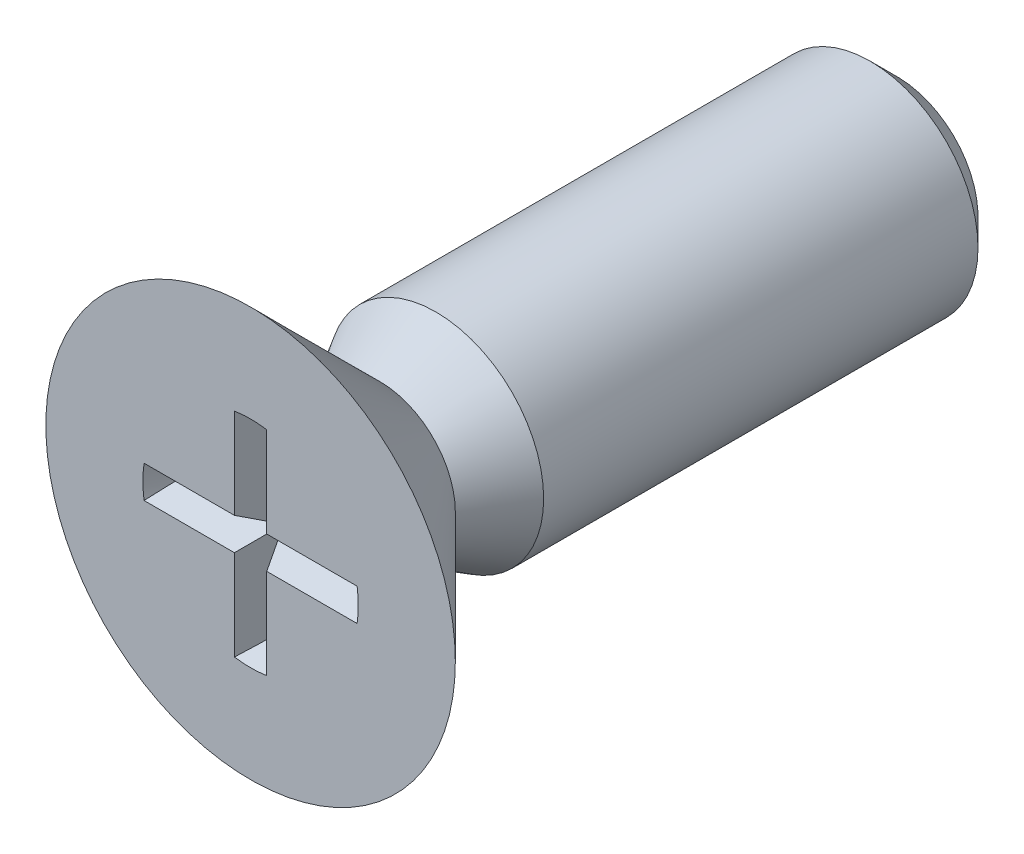
ISO-10303-21;
HEADER;
FILE_DESCRIPTION(('STEP AP214'),'2;1');
FILE_NAME('part.step','',(''),(''),'','','');
FILE_SCHEMA(('AUTOMOTIVE_DESIGN { 1 0 10303 214 1 1 1 1 }'));
ENDSEC;
DATA;
#1=APPLICATION_CONTEXT('core data for automotive mechanical design processes');
#2=APPLICATION_PROTOCOL_DEFINITION('international standard','automotive_design',2000,#1);
#3=PRODUCT_CONTEXT('',#1,'mechanical');
#4=PRODUCT('Part','Part','',(#3));
#5=PRODUCT_RELATED_PRODUCT_CATEGORY('part','',(#4));
#6=PRODUCT_DEFINITION_FORMATION('','',#4);
#7=PRODUCT_DEFINITION_CONTEXT('part definition',#1,'design');
#8=PRODUCT_DEFINITION('design','',#6,#7);
#9=PRODUCT_DEFINITION_SHAPE('','',#8);
#10=(LENGTH_UNIT() NAMED_UNIT(*) SI_UNIT(.MILLI.,.METRE.));
#11=(NAMED_UNIT(*) PLANE_ANGLE_UNIT() SI_UNIT($,.RADIAN.));
#12=(NAMED_UNIT(*) SI_UNIT($,.STERADIAN.) SOLID_ANGLE_UNIT());
#13=UNCERTAINTY_MEASURE_WITH_UNIT(LENGTH_MEASURE(1.E-05),#10,'distance_accuracy_value','');
#14=(GEOMETRIC_REPRESENTATION_CONTEXT(3) GLOBAL_UNCERTAINTY_ASSIGNED_CONTEXT((#13)) GLOBAL_UNIT_ASSIGNED_CONTEXT((#10,
#11,#12)) REPRESENTATION_CONTEXT('',''));
#15=CARTESIAN_POINT('',(0.,0.,0.));
#16=DIRECTION('',(0.,0.,1.));
#17=DIRECTION('',(1.,0.,0.));
#18=AXIS2_PLACEMENT_3D('',#15,#16,#17);
#19=CARTESIAN_POINT('',(0.,0.,0.));
#20=DIRECTION('',(0.,0.,0.999999999999933));
#21=DIRECTION('',(0.999999999999925,0.,0.));
#22=AXIS2_PLACEMENT_3D('',#19,#20,#21);
#23=PLANE('',#22);
#24=DIRECTION('',(-0.999999999999925,0.,0.));
#25=VECTOR('',#24,1.);
#26=CARTESIAN_POINT('',(-0.149999999999595,0.149999999999609,0.));
#27=LINE('',#26,#25);
#28=CARTESIAN_POINT('',(-0.149999999999595,0.149999999999609,0.));
#29=VERTEX_POINT('',#28);
#30=CARTESIAN_POINT('',(-0.98868599666313,0.149999999999595,0.));
#31=VERTEX_POINT('',#30);
#32=EDGE_CURVE('E63',#29,#31,#27,.T.);
#33=ORIENTED_EDGE('',*,*,#32,.F.);
#34=DIRECTION('',(0.,-1.,0.));
#35=VECTOR('',#34,1.);
#36=CARTESIAN_POINT('',(-0.149999999999595,0.149999999999609,0.));
#37=LINE('',#36,#35);
#38=CARTESIAN_POINT('',(-0.149999999999845,0.988685996664171,0.));
#39=VERTEX_POINT('',#38);
#40=EDGE_CURVE('E163',#39,#29,#37,.T.);
#41=ORIENTED_EDGE('',*,*,#40,.F.);
#42=CARTESIAN_POINT('',(0.,0.,0.));
#43=DIRECTION('',(0.,0.,0.999999999999933));
#44=DIRECTION('',(0.999999999999925,0.,0.));
#45=AXIS2_PLACEMENT_3D('',#42,#43,#44);
#46=CIRCLE('',#45,1.);
#47=CARTESIAN_POINT('',(0.149999999998679,0.988685996663907,0.));
#48=VERTEX_POINT('',#47);
#49=EDGE_CURVE('E160',#48,#39,#46,.T.);
#50=ORIENTED_EDGE('',*,*,#49,.F.);
#51=DIRECTION('',(0.,1.,0.));
#52=VECTOR('',#51,1.);
#53=CARTESIAN_POINT('',(0.149999999998679,0.988685996663907,0.));
#54=LINE('',#53,#52);
#55=CARTESIAN_POINT('',(0.149999999999428,0.149999999999817,0.));
#56=VERTEX_POINT('',#55);
#57=EDGE_CURVE('E157',#56,#48,#54,.T.);
#58=ORIENTED_EDGE('',*,*,#57,.F.);
#59=DIRECTION('',(-0.999999999999925,0.,0.));
#60=VECTOR('',#59,1.);
#61=CARTESIAN_POINT('',(0.149999999999428,0.149999999999817,0.));
#62=LINE('',#61,#60);
#63=CARTESIAN_POINT('',(0.988685996663963,0.149999999999914,0.));
#64=VERTEX_POINT('',#63);
#65=EDGE_CURVE('E154',#64,#56,#62,.T.);
#66=ORIENTED_EDGE('',*,*,#65,.F.);
#67=CARTESIAN_POINT('',(0.,0.,0.));
#68=DIRECTION('',(0.,0.,0.999999999999933));
#69=DIRECTION('',(0.999999999999925,0.,0.));
#70=AXIS2_PLACEMENT_3D('',#67,#68,#69);
#71=CIRCLE('',#70,1.);
#72=CARTESIAN_POINT('',(0.988685996663824,-0.150000000000136,0.));
#73=VERTEX_POINT('',#72);
#74=EDGE_CURVE('E151',#73,#64,#71,.T.);
#75=ORIENTED_EDGE('',*,*,#74,.F.);
#76=DIRECTION('',(0.999999999999925,0.,0.));
#77=VECTOR('',#76,1.);
#78=CARTESIAN_POINT('',(0.150000000000039,-0.149999999999956,0.));
#79=LINE('',#78,#77);
#80=CARTESIAN_POINT('',(0.150000000000039,-0.149999999999956,0.));
#81=VERTEX_POINT('',#80);
#82=EDGE_CURVE('E148',#81,#73,#79,.T.);
#83=ORIENTED_EDGE('',*,*,#82,.F.);
#84=DIRECTION('',(0.,1.,0.));
#85=VECTOR('',#84,1.);
#86=CARTESIAN_POINT('',(0.150000000000039,-0.149999999999956,0.));
#87=LINE('',#86,#85);
#88=CARTESIAN_POINT('',(0.150000000000039,-0.988685996664226,0.));
#89=VERTEX_POINT('',#88);
#90=EDGE_CURVE('E145',#89,#81,#87,.T.);
#91=ORIENTED_EDGE('',*,*,#90,.F.);
#92=CARTESIAN_POINT('',(0.,0.,0.));
#93=DIRECTION('',(0.,0.,0.999999999999933));
#94=DIRECTION('',(0.999999999999925,0.,0.));
#95=AXIS2_PLACEMENT_3D('',#92,#93,#94);
#96=CIRCLE('',#95,1.);
#97=CARTESIAN_POINT('',(-0.14999999999965,-0.988685996664518,0.));
#98=VERTEX_POINT('',#97);
#99=EDGE_CURVE('E139',#98,#89,#96,.T.);
#100=ORIENTED_EDGE('',*,*,#99,.F.);
#101=DIRECTION('',(0.,-1.,0.));
#102=VECTOR('',#101,1.);
#103=CARTESIAN_POINT('',(-0.149999999998623,-0.150000000000511,0.));
#104=LINE('',#103,#102);
#105=CARTESIAN_POINT('',(-0.149999999998623,-0.150000000000511,0.));
#106=VERTEX_POINT('',#105);
#107=EDGE_CURVE('E137',#106,#98,#104,.T.);
#108=ORIENTED_EDGE('',*,*,#107,.F.);
#109=DIRECTION('',(0.999999999999925,0.,0.));
#110=VECTOR('',#109,1.);
#111=CARTESIAN_POINT('',(-0.149999999998623,-0.150000000000511,0.));
#112=LINE('',#111,#110);
#113=CARTESIAN_POINT('',(-0.98868599666363,-0.150000000000372,0.));
#114=VERTEX_POINT('',#113);
#115=EDGE_CURVE('E122',#114,#106,#112,.T.);
#116=ORIENTED_EDGE('',*,*,#115,.F.);
#117=CARTESIAN_POINT('',(0.,0.,0.));
#118=DIRECTION('',(0.,0.,0.999999999999933));
#119=DIRECTION('',(0.999999999999925,0.,0.));
#120=AXIS2_PLACEMENT_3D('',#117,#118,#119);
#121=CIRCLE('',#120,1.);
#122=EDGE_CURVE('E130',#31,#114,#121,.T.);
#123=ORIENTED_EDGE('',*,*,#122,.F.);
#124=EDGE_LOOP('',(#33,#41,#50,#58,#66,#75,#83,#91,#100,#108,#116,#123));
#125=FACE_BOUND('',#124,.T.);
#126=CARTESIAN_POINT('',(0.,0.,0.));
#127=DIRECTION('',(0.,0.,-0.999999999999933));
#128=DIRECTION('',(-0.999999999999925,0.,0.));
#129=AXIS2_PLACEMENT_3D('',#126,#127,#128);
#130=CIRCLE('',#129,1.9);
#131=CARTESIAN_POINT('',(1.89999999999995,0.,0.));
#132=VERTEX_POINT('',#131);
#133=EDGE_CURVE('E375',#132,#132,#130,.T.);
#134=ORIENTED_EDGE('',*,*,#133,.F.);
#135=EDGE_LOOP('',(#134));
#136=FACE_BOUND('',#135,.T.);
#137=ADVANCED_FACE('F48',(#125,#136),#23,.T.);
#138=CARTESIAN_POINT('',(0.,0.,-1.20000000000001));
#139=DIRECTION('',(0.,0.,0.999999999999933));
#140=DIRECTION('',(0.999999999999925,0.,0.));
#141=AXIS2_PLACEMENT_3D('',#138,#139,#140);
#142=CONICAL_SURFACE('',#141,0.700000000000005,0.785398163397446);
#143=CARTESIAN_POINT('',(0.,0.,-1.20000000000001));
#144=DIRECTION('',(0.,0.,-0.999999999999933));
#145=DIRECTION('',(-0.999999999999925,0.,0.));
#146=AXIS2_PLACEMENT_3D('',#143,#144,#145);
#147=CIRCLE('',#146,0.700000000000005);
#148=CARTESIAN_POINT('',(0.699999999999953,0.,-1.20000000000001));
#149=VERTEX_POINT('',#148);
#150=EDGE_CURVE('E372',#149,#149,#147,.T.);
#151=CARTESIAN_POINT('',(1.89999999999995,0.,0.));
#152=CARTESIAN_POINT('',(1.88749999999995,0.,-0.0124999999999998));
#153=CARTESIAN_POINT('',(1.87499999999995,0.,-0.0249999999999999));
#154=CARTESIAN_POINT('',(1.84999999999995,0.,-0.0500000000000001));
#155=CARTESIAN_POINT('',(1.83749999999995,0.,-0.0625000000000001));
#156=CARTESIAN_POINT('',(1.81249999999995,0.,-0.0875000000000003));
#157=CARTESIAN_POINT('',(1.79999999999995,0.,-0.1));
#158=CARTESIAN_POINT('',(1.77499999999995,0.,-0.125));
#159=CARTESIAN_POINT('',(1.76249999999995,0.,-0.137500000000001));
#160=CARTESIAN_POINT('',(1.73749999999995,0.,-0.162500000000001));
#161=CARTESIAN_POINT('',(1.72499999999995,0.,-0.175000000000001));
#162=CARTESIAN_POINT('',(1.69999999999995,0.,-0.200000000000001));
#163=CARTESIAN_POINT('',(1.68749999999995,0.,-0.212500000000001));
#164=CARTESIAN_POINT('',(1.66249999999995,0.,-0.237500000000001));
#165=CARTESIAN_POINT('',(1.64999999999995,0.,-0.250000000000001));
#166=CARTESIAN_POINT('',(1.62499999999995,0.,-0.275000000000001));
#167=CARTESIAN_POINT('',(1.61249999999995,0.,-0.287500000000001));
#168=CARTESIAN_POINT('',(1.58749999999995,0.,-0.312500000000001));
#169=CARTESIAN_POINT('',(1.57499999999995,0.,-0.325000000000002));
#170=CARTESIAN_POINT('',(1.54999999999995,0.,-0.350000000000002));
#171=CARTESIAN_POINT('',(1.53749999999995,0.,-0.362500000000002));
#172=CARTESIAN_POINT('',(1.51249999999995,0.,-0.387500000000002));
#173=CARTESIAN_POINT('',(1.49999999999995,0.,-0.400000000000002));
#174=CARTESIAN_POINT('',(1.47499999999995,0.,-0.425000000000002));
#175=CARTESIAN_POINT('',(1.46249999999995,0.,-0.437500000000002));
#176=CARTESIAN_POINT('',(1.43749999999995,0.,-0.462500000000002));
#177=CARTESIAN_POINT('',(1.42499999999995,0.,-0.475000000000002));
#178=CARTESIAN_POINT('',(1.39999999999995,0.,-0.500000000000003));
#179=CARTESIAN_POINT('',(1.38749999999995,0.,-0.512500000000003));
#180=CARTESIAN_POINT('',(1.36249999999995,0.,-0.537500000000003));
#181=CARTESIAN_POINT('',(1.34999999999995,0.,-0.550000000000003));
#182=CARTESIAN_POINT('',(1.32499999999995,0.,-0.575000000000003));
#183=CARTESIAN_POINT('',(1.31249999999995,0.,-0.587500000000003));
#184=CARTESIAN_POINT('',(1.28749999999995,0.,-0.612500000000003));
#185=CARTESIAN_POINT('',(1.27499999999995,0.,-0.625000000000003));
#186=CARTESIAN_POINT('',(1.24999999999995,0.,-0.650000000000004));
#187=CARTESIAN_POINT('',(1.23749999999995,0.,-0.662500000000004));
#188=CARTESIAN_POINT('',(1.21249999999995,0.,-0.687500000000004));
#189=CARTESIAN_POINT('',(1.19999999999995,0.,-0.700000000000004));
#190=CARTESIAN_POINT('',(1.17499999999995,0.,-0.725000000000004));
#191=CARTESIAN_POINT('',(1.16249999999995,0.,-0.737500000000004));
#192=CARTESIAN_POINT('',(1.13749999999995,0.,-0.762500000000004));
#193=CARTESIAN_POINT('',(1.12499999999995,0.,-0.775000000000004));
#194=CARTESIAN_POINT('',(1.09999999999995,0.,-0.800000000000004));
#195=CARTESIAN_POINT('',(1.08749999999995,0.,-0.812500000000005));
#196=CARTESIAN_POINT('',(1.06249999999995,0.,-0.837500000000005));
#197=CARTESIAN_POINT('',(1.04999999999995,0.,-0.850000000000005));
#198=CARTESIAN_POINT('',(1.02499999999995,0.,-0.875000000000005));
#199=CARTESIAN_POINT('',(1.01249999999995,0.,-0.887500000000005));
#200=CARTESIAN_POINT('',(0.987499999999951,0.,-0.912500000000005));
#201=CARTESIAN_POINT('',(0.974999999999951,0.,-0.925000000000005));
#202=CARTESIAN_POINT('',(0.949999999999952,0.,-0.950000000000005));
#203=CARTESIAN_POINT('',(0.937499999999952,0.,-0.962500000000005));
#204=CARTESIAN_POINT('',(0.912499999999952,0.,-0.987500000000005));
#205=CARTESIAN_POINT('',(0.899999999999952,0.,-1.00000000000001));
#206=CARTESIAN_POINT('',(0.874999999999952,0.,-1.02500000000001));
#207=CARTESIAN_POINT('',(0.862499999999952,0.,-1.03750000000001));
#208=CARTESIAN_POINT('',(0.837499999999952,0.,-1.06250000000001));
#209=CARTESIAN_POINT('',(0.824999999999952,0.,-1.07500000000001));
#210=CARTESIAN_POINT('',(0.799999999999953,0.,-1.10000000000001));
#211=CARTESIAN_POINT('',(0.787499999999953,0.,-1.11250000000001));
#212=CARTESIAN_POINT('',(0.762499999999953,0.,-1.13750000000001));
#213=CARTESIAN_POINT('',(0.749999999999953,0.,-1.15000000000001));
#214=CARTESIAN_POINT('',(0.724999999999953,0.,-1.17500000000001));
#215=CARTESIAN_POINT('',(0.712499999999953,0.,-1.18750000000001));
#216=CARTESIAN_POINT('',(0.699999999999953,0.,-1.20000000000001));
#217=B_SPLINE_CURVE_WITH_KNOTS('',3,(#151,#152,#153,#154,#155,#156,#157,#158,#159,#160,#161,
#162,#163,#164,#165,#166,#167,#168,#169,#170,#171,#172,#173,#174,#175,#176,#177,#178,#179,#180,
#181,#182,#183,#184,#185,#186,#187,#188,#189,#190,#191,#192,#193,#194,#195,#196,#197,#198,#199,
#200,#201,#202,#203,#204,#205,#206,#207,#208,#209,#210,#211,#212,#213,#214,#215,#216),
.UNSPECIFIED.,.F.,.F.,(4,2,2,2,2,2,2,2,2,2,2,2,2,2,2,2,2,2,2,2,2,2,2,2,2,2,2,2,2,2,2,2,4),(0.,
0.0530330085889911,0.106066017177982,0.159099025766973,0.212132034355964,0.265165042944955,
0.318198051533946,0.371231060122937,0.424264068711928,0.477297077300919,0.53033008588991,
0.583363094478901,0.636396103067892,0.689429111656883,0.742462120245875,0.795495128834866,
0.848528137423857,0.901561146012848,0.954594154601839,1.00762716319083,1.06066017177982,
1.11369318036881,1.1667261889578,1.21975919754679,1.27279220613579,1.32582521472478,
1.37885822331377,1.43189123190276,1.48492424049175,1.53795724908074,1.59099025766973,
1.64402326625872,1.69705627484771),.UNSPECIFIED.);
#218=EDGE_CURVE('BSEAM272',#132,#149,#217,.T.);
#219=ORIENTED_EDGE('',*,*,#133,.T.);
#220=ORIENTED_EDGE('',*,*,#150,.F.);
#221=ORIENTED_EDGE('',*,*,#218,.T.);
#222=ORIENTED_EDGE('',*,*,#218,.F.);
#223=EDGE_LOOP('',(#219,#221,#220,#222));
#224=FACE_BOUND('',#223,.T.);
#225=ADVANCED_FACE('F272',(#224),#142,.T.);
#226=CARTESIAN_POINT('',(0.,0.,-1.71961524227066));
#227=DIRECTION('',(0.,0.,-0.999999999999933));
#228=DIRECTION('',(-0.999999999999925,0.,0.));
#229=AXIS2_PLACEMENT_3D('',#226,#227,#228);
#230=CONICAL_SURFACE('',#229,1.,0.523598775598293);
#231=ORIENTED_EDGE('',*,*,#150,.T.);
#232=EDGE_LOOP('',(#231));
#233=FACE_BOUND('',#232,.T.);
#234=CARTESIAN_POINT('',(0.,0.,-1.71961524227066));
#235=DIRECTION('',(0.,0.,-0.999999999999933));
#236=DIRECTION('',(-0.999999999999925,0.,0.));
#237=AXIS2_PLACEMENT_3D('',#234,#235,#236);
#238=CIRCLE('',#237,1.);
#239=CARTESIAN_POINT('',(-1.00000000000029,0.,-1.71961524227066));
#240=VERTEX_POINT('',#239);
#241=EDGE_CURVE('E366',#240,#240,#238,.T.);
#242=ORIENTED_EDGE('',*,*,#241,.F.);
#243=EDGE_LOOP('',(#242));
#244=FACE_BOUND('',#243,.T.);
#245=ADVANCED_FACE('F268',(#233,#244),#230,.T.);
#246=CARTESIAN_POINT('',(-3.60822483003176E-13,0.,-6.00000000000001));
#247=DIRECTION('',(0.,0.,-0.999999999999933));
#248=DIRECTION('',(-0.999999999999925,0.,0.));
#249=AXIS2_PLACEMENT_3D('',#246,#247,#248);
#250=CYLINDRICAL_SURFACE('',#249,1.);
#251=CARTESIAN_POINT('',(-3.60822483003176E-13,0.,-5.74999999999999));
#252=DIRECTION('',(0.,0.,-0.999999999999933));
#253=DIRECTION('',(-0.999999999999925,0.,0.));
#254=AXIS2_PLACEMENT_3D('',#251,#252,#253);
#255=CIRCLE('',#254,1.);
#256=CARTESIAN_POINT('',(-1.00000000000029,0.,-5.74999999999999));
#257=VERTEX_POINT('',#256);
#258=EDGE_CURVE('E13',#257,#257,#255,.F.);
#259=CARTESIAN_POINT('',(-1.00000000000029,0.,-5.74999999999999));
#260=CARTESIAN_POINT('',(-1.00000000000029,0.,-5.70801682544031));
#261=CARTESIAN_POINT('',(-1.00000000000029,0.,-5.66603365088063));
#262=CARTESIAN_POINT('',(-1.00000000000029,0.,-5.58206730176127));
#263=CARTESIAN_POINT('',(-1.00000000000029,0.,-5.54008412720159));
#264=CARTESIAN_POINT('',(-1.00000000000029,0.,-5.45611777808223));
#265=CARTESIAN_POINT('',(-1.00000000000029,0.,-5.41413460352255));
#266=CARTESIAN_POINT('',(-1.00000000000029,0.,-5.33016825440319));
#267=CARTESIAN_POINT('',(-1.00000000000029,0.,-5.28818507984351));
#268=CARTESIAN_POINT('',(-1.00000000000029,0.,-5.20421873072414));
#269=CARTESIAN_POINT('',(-1.00000000000029,0.,-5.16223555616446));
#270=CARTESIAN_POINT('',(-1.00000000000029,0.,-5.0782692070451));
#271=CARTESIAN_POINT('',(-1.00000000000029,0.,-5.03628603248542));
#272=CARTESIAN_POINT('',(-1.00000000000029,0.,-4.95231968336606));
#273=CARTESIAN_POINT('',(-1.00000000000029,0.,-4.91033650880638));
#274=CARTESIAN_POINT('',(-1.00000000000029,0.,-4.82637015968702));
#275=CARTESIAN_POINT('',(-1.00000000000029,0.,-4.78438698512734));
#276=CARTESIAN_POINT('',(-1.00000000000029,0.,-4.70042063600798));
#277=CARTESIAN_POINT('',(-1.00000000000029,0.,-4.6584374614483));
#278=CARTESIAN_POINT('',(-1.00000000000029,0.,-4.57447111232894));
#279=CARTESIAN_POINT('',(-1.00000000000029,0.,-4.53248793776926));
#280=CARTESIAN_POINT('',(-1.00000000000029,0.,-4.44852158864989));
#281=CARTESIAN_POINT('',(-1.00000000000029,0.,-4.40653841409021));
#282=CARTESIAN_POINT('',(-1.00000000000029,0.,-4.32257206497085));
#283=CARTESIAN_POINT('',(-1.00000000000029,0.,-4.28058889041117));
#284=CARTESIAN_POINT('',(-1.00000000000029,0.,-4.19662254129181));
#285=CARTESIAN_POINT('',(-1.00000000000029,0.,-4.15463936673213));
#286=CARTESIAN_POINT('',(-1.00000000000029,0.,-4.07067301761277));
#287=CARTESIAN_POINT('',(-1.00000000000029,0.,-4.02868984305309));
#288=CARTESIAN_POINT('',(-1.00000000000029,0.,-3.94472349393373));
#289=CARTESIAN_POINT('',(-1.00000000000029,0.,-3.90274031937405));
#290=CARTESIAN_POINT('',(-1.00000000000029,0.,-3.81877397025469));
#291=CARTESIAN_POINT('',(-1.00000000000029,0.,-3.77679079569501));
#292=CARTESIAN_POINT('',(-1.00000000000029,0.,-3.69282444657564));
#293=CARTESIAN_POINT('',(-1.00000000000029,0.,-3.65084127201596));
#294=CARTESIAN_POINT('',(-1.00000000000029,0.,-3.5668749228966));
#295=CARTESIAN_POINT('',(-1.00000000000029,0.,-3.52489174833692));
#296=CARTESIAN_POINT('',(-1.00000000000029,0.,-3.44092539921756));
#297=CARTESIAN_POINT('',(-1.00000000000029,0.,-3.39894222465788));
#298=CARTESIAN_POINT('',(-1.00000000000029,0.,-3.31497587553852));
#299=CARTESIAN_POINT('',(-1.00000000000029,0.,-3.27299270097884));
#300=CARTESIAN_POINT('',(-1.00000000000029,0.,-3.18902635185948));
#301=CARTESIAN_POINT('',(-1.00000000000029,0.,-3.1470431772998));
#302=CARTESIAN_POINT('',(-1.00000000000029,0.,-3.06307682818044));
#303=CARTESIAN_POINT('',(-1.00000000000029,0.,-3.02109365362075));
#304=CARTESIAN_POINT('',(-1.00000000000029,0.,-2.93712730450139));
#305=CARTESIAN_POINT('',(-1.00000000000029,0.,-2.89514412994171));
#306=CARTESIAN_POINT('',(-1.00000000000029,0.,-2.81117778082235));
#307=CARTESIAN_POINT('',(-1.00000000000029,0.,-2.76919460626267));
#308=CARTESIAN_POINT('',(-1.00000000000029,0.,-2.68522825714331));
#309=CARTESIAN_POINT('',(-1.00000000000029,0.,-2.64324508258363));
#310=CARTESIAN_POINT('',(-1.00000000000029,0.,-2.55927873346427));
#311=CARTESIAN_POINT('',(-1.00000000000029,0.,-2.51729555890459));
#312=CARTESIAN_POINT('',(-1.00000000000029,0.,-2.43332920978523));
#313=CARTESIAN_POINT('',(-1.00000000000029,0.,-2.39134603522555));
#314=CARTESIAN_POINT('',(-1.00000000000029,0.,-2.30737968610618));
#315=CARTESIAN_POINT('',(-1.00000000000029,0.,-2.2653965115465));
#316=CARTESIAN_POINT('',(-1.00000000000029,0.,-2.18143016242714));
#317=CARTESIAN_POINT('',(-1.00000000000029,0.,-2.13944698786746));
#318=CARTESIAN_POINT('',(-1.00000000000029,0.,-2.0554806387481));
#319=CARTESIAN_POINT('',(-1.00000000000029,0.,-2.01349746418842));
#320=CARTESIAN_POINT('',(-1.00000000000029,0.,-1.92953111506906));
#321=CARTESIAN_POINT('',(-1.00000000000029,0.,-1.88754794050938));
#322=CARTESIAN_POINT('',(-1.00000000000029,0.,-1.80358159139002));
#323=CARTESIAN_POINT('',(-1.00000000000029,0.,-1.76159841683034));
#324=CARTESIAN_POINT('',(-1.00000000000029,0.,-1.71961524227066));
#325=B_SPLINE_CURVE_WITH_KNOTS('',3,(#259,#260,#261,#262,#263,#264,#265,#266,#267,#268,#269,
#270,#271,#272,#273,#274,#275,#276,#277,#278,#279,#280,#281,#282,#283,#284,#285,#286,#287,#288,
#289,#290,#291,#292,#293,#294,#295,#296,#297,#298,#299,#300,#301,#302,#303,#304,#305,#306,#307,
#308,#309,#310,#311,#312,#313,#314,#315,#316,#317,#318,#319,#320,#321,#322,#323,#324),
.UNSPECIFIED.,.F.,.F.,(4,2,2,2,2,2,2,2,2,2,2,2,2,2,2,2,2,2,2,2,2,2,2,2,2,2,2,2,2,2,2,2,4),(0.,
0.125949523679042,0.251899047358083,0.377848571037126,0.503798094716167,0.629747618395209,
0.75569714207425,0.881646665753293,1.00759618943233,1.13354571311138,1.25949523679042,
1.38544476046946,1.5113942841485,1.63734380782754,1.76329333150658,1.88924285518563,
2.01519237886467,2.14114190254371,2.26709142622275,2.39304094990179,2.51899047358083,
2.64493999725988,2.77088952093892,2.89683904461796,3.022788568297,3.14873809197604,
3.27468761565509,3.40063713933413,3.52658666301317,3.65253618669221,3.77848571037125,
3.90443523405029,4.03038475772934),.UNSPECIFIED.);
#326=EDGE_CURVE('BSEAM264',#257,#240,#325,.T.);
#327=ORIENTED_EDGE('',*,*,#258,.T.);
#328=ORIENTED_EDGE('',*,*,#241,.T.);
#329=ORIENTED_EDGE('',*,*,#326,.T.);
#330=ORIENTED_EDGE('',*,*,#326,.F.);
#331=EDGE_LOOP('',(#327,#329,#328,#330));
#332=FACE_BOUND('',#331,.T.);
#333=ADVANCED_FACE('F264',(#332),#250,.T.);
#334=CARTESIAN_POINT('',(-0.999999999999918,0.,-6.00000000000001));
#335=DIRECTION('',(0.,0.,-0.999999999999933));
#336=DIRECTION('',(-0.999999999999925,0.,0.));
#337=AXIS2_PLACEMENT_3D('',#334,#335,#336);
#338=PLANE('',#337);
#339=CARTESIAN_POINT('',(-3.60822483003176E-13,0.,-6.00000000000001));
#340=DIRECTION('',(0.,0.,-0.999999999999933));
#341=DIRECTION('',(-0.999999999999925,0.,0.));
#342=AXIS2_PLACEMENT_3D('',#339,#340,#341);
#343=CIRCLE('',#342,0.749999999999997);
#344=CARTESIAN_POINT('',(-0.750000000000302,0.,-6.00000000000001));
#345=VERTEX_POINT('',#344);
#346=EDGE_CURVE('E56',#345,#345,#343,.T.);
#347=ORIENTED_EDGE('',*,*,#346,.T.);
#348=EDGE_LOOP('',(#347));
#349=FACE_BOUND('',#348,.T.);
#350=ADVANCED_FACE('F261',(#349),#338,.T.);
#351=CARTESIAN_POINT('',(-3.60822483003176E-13,0.,-6.00000000000001));
#352=DIRECTION('',(0.,0.,0.999999999999933));
#353=DIRECTION('',(0.999999999999925,0.,0.));
#354=AXIS2_PLACEMENT_3D('',#351,#352,#353);
#355=CONICAL_SURFACE('',#354,0.749999999999997,0.785398163397447);
#356=ORIENTED_EDGE('',*,*,#258,.F.);
#357=EDGE_LOOP('',(#356));
#358=FACE_BOUND('',#357,.T.);
#359=ORIENTED_EDGE('',*,*,#346,.F.);
#360=EDGE_LOOP('',(#359));
#361=FACE_BOUND('',#360,.T.);
#362=ADVANCED_FACE('F50',(#358,#361),#355,.T.);
#363=CARTESIAN_POINT('',(-0.149999999999595,0.149999999999609,0.));
#364=DIRECTION('',(0.,0.898794046299205,-0.438371146789045));
#365=DIRECTION('',(0.,0.438371146789089,0.8987940462991));
#366=AXIS2_PLACEMENT_3D('',#363,#364,#365);
#367=PLANE('',#366);
#368=DIRECTION('',(0.999999999999925,0.,0.));
#369=VECTOR('',#368,1.);
#370=CARTESIAN_POINT('',(-0.150000000000011,0.,-0.307545576236898));
#371=LINE('',#370,#369);
#372=CARTESIAN_POINT('',(-0.849999999998324,-3.88578058618805E-13,-0.30754557623687));
#373=VERTEX_POINT('',#372);
#374=CARTESIAN_POINT('',(0.,0.,-0.307545576236898));
#375=VERTEX_POINT('',#374);
#376=EDGE_CURVE('E124',#373,#375,#371,.T.);
#377=ORIENTED_EDGE('',*,*,#376,.T.);
#378=DIRECTION('',(-0.401488399504185,0.401488399504237,0.823173207852974));
#379=VECTOR('',#378,1.);
#380=CARTESIAN_POINT('',(-0.149999999999595,0.149999999999609,0.));
#381=LINE('',#380,#379);
#382=EDGE_CURVE('E166',#375,#29,#381,.T.);
#383=ORIENTED_EDGE('',*,*,#382,.T.);
#384=ORIENTED_EDGE('',*,*,#32,.T.);
#385=CARTESIAN_POINT('',(-0.255812547349826,-0.386505847422586,-1.1));
#386=CARTESIAN_POINT('',(-0.275449476755664,-0.380586949186411,-1.08786446020826));
#387=CARTESIAN_POINT('',(-0.294343623056731,-0.374230059116617,-1.07483090407753));
#388=CARTESIAN_POINT('',(-0.330763173530504,-0.360840964152099,-1.04737919123637));
#389=CARTESIAN_POINT('',(-0.348292174271361,-0.353810650647116,-1.0329649124496));
#390=CARTESIAN_POINT('',(-0.398801593069938,-0.332110001320866,-0.988471987771413));
#391=CARTESIAN_POINT('',(-0.430110390480368,-0.316697589843654,-0.956871861312072));
#392=CARTESIAN_POINT('',(-0.483444739600536,-0.287847492267538,-0.897720395421734));
#393=CARTESIAN_POINT('',(-0.506083444637852,-0.274619707177513,-0.870599416835747));
#394=CARTESIAN_POINT('',(-0.54957831896426,-0.247609187079543,-0.815219643715576));
#395=CARTESIAN_POINT('',(-0.570434061972281,-0.233826320511742,-0.786960579443713));
#396=CARTESIAN_POINT('',(-0.630884700857411,-0.191835984401508,-0.700867632007812));
#397=CARTESIAN_POINT('',(-0.668292969332029,-0.163026859804804,-0.641800173174592));
#398=CARTESIAN_POINT('',(-0.739433854687907,-0.104121699148738,-0.521026695992534));
#399=CARTESIAN_POINT('',(-0.773115774397824,-0.0740142144032057,-0.459297204358459));
#400=CARTESIAN_POINT('',(-0.837352283028038,-0.0131600904000827,-0.334527760138989));
#401=CARTESIAN_POINT('',(-0.86790612693324,0.0175866990328323,-0.27148749964855));
#402=CARTESIAN_POINT('',(-0.913221440905053,0.0654233686006166,-0.173407792265299));
#403=CARTESIAN_POINT('',(-0.928840990299744,0.0823593545789318,-0.138683875152964));
#404=CARTESIAN_POINT('',(-0.95929080095423,0.116182300541757,-0.0693365591117664));
#405=CARTESIAN_POINT('',(-0.974127128867204,0.133068209889194,-0.0347153143081323));
#406=CARTESIAN_POINT('',(-0.98868599666313,0.149999999999595,0.));
#407=B_SPLINE_CURVE_WITH_KNOTS('',3,(#385,#386,#387,#388,#389,#390,#391,#392,#393,#394,#395,
#396,#397,#398,#399,#400,#401,#402,#403,#404,#405,#406),.UNSPECIFIED.,.F.,.F.,(4,2,2,2,2,2,2,2,
2,2,4),(0.,0.0713922150153188,0.142589488762265,0.283481517406613,0.39659096109922,
0.509727372472828,0.736344172180906,0.965739833420187,1.19519000343479,1.32020137058027,
1.44403068561773),.UNSPECIFIED.);
#408=EDGE_CURVE('E127',#373,#31,#407,.T.);
#409=ORIENTED_EDGE('',*,*,#408,.F.);
#410=EDGE_LOOP('',(#377,#383,#384,#409));
#411=FACE_BOUND('',#410,.T.);
#412=ADVANCED_FACE('F180',(#411),#367,.F.);
#413=CARTESIAN_POINT('',(-0.149999999999595,0.149999999999609,0.));
#414=DIRECTION('',(-0.898794046299106,0.,-0.438371146789046));
#415=DIRECTION('',(-0.438371146789035,0.,0.8987940462991));
#416=AXIS2_PLACEMENT_3D('',#413,#414,#415);
#417=PLANE('',#416);
#418=CARTESIAN_POINT('',(0.386505847422058,0.255812547350354,-1.1));
#419=CARTESIAN_POINT('',(0.380586949186121,0.275449476756121,-1.08786446020808));
#420=CARTESIAN_POINT('',(0.374230059116462,0.294343623057129,-1.07483090407724));
#421=CARTESIAN_POINT('',(0.360840964152069,0.330763173530826,-1.04737919123599));
#422=CARTESIAN_POINT('',(0.353810650647076,0.348292174271664,-1.03296491244922));
#423=CARTESIAN_POINT('',(0.332110001320673,0.398801593070249,-0.98847198777118));
#424=CARTESIAN_POINT('',(0.316697589843197,0.430110390480766,-0.956871861312086));
#425=CARTESIAN_POINT('',(0.287847492267147,0.48344473960088,-0.897720395421708));
#426=CARTESIAN_POINT('',(0.274619707177343,0.506083444638099,-0.870599416835527));
#427=CARTESIAN_POINT('',(0.247609187079535,0.549578318964425,-0.815219643715202));
#428=CARTESIAN_POINT('',(0.233826320511676,0.570434061972463,-0.786960579443378));
#429=CARTESIAN_POINT('',(0.191835984401325,0.630884700857662,-0.700867632007528));
#430=CARTESIAN_POINT('',(0.163026859804629,0.668292969332332,-0.64180017317427));
#431=CARTESIAN_POINT('',(0.104121699148595,0.739433854688066,-0.521026695992044));
#432=CARTESIAN_POINT('',(0.0740142144030845,0.773115774397784,-0.459297204357837));
#433=CARTESIAN_POINT('',(0.0131600903998022,0.837352283028557,-0.334527760138676));
#434=CARTESIAN_POINT('',(-0.0175866990332942,0.867906126934517,-0.271487499648677));
#435=CARTESIAN_POINT('',(-0.0654233686009852,0.9132214409059,-0.173407792265255));
#436=CARTESIAN_POINT('',(-0.0823593545791851,0.928840990300124,-0.138683875152717));
#437=CARTESIAN_POINT('',(-0.116182300541816,0.959290800954152,-0.0693365591113383));
#438=CARTESIAN_POINT('',(-0.133068209889174,0.974127128867132,-0.0347153143077238));
#439=CARTESIAN_POINT('',(-0.149999999999595,0.988685996663824,0.));
#440=B_SPLINE_CURVE_WITH_KNOTS('',3,(#418,#419,#420,#421,#422,#423,#424,#425,#426,#427,#428,
#429,#430,#431,#432,#433,#434,#435,#436,#437,#438,#439),.UNSPECIFIED.,.F.,.F.,(4,2,2,2,2,2,2,2,
2,2,4),(0.,0.0713922150152465,0.142589488762153,0.283481517406427,0.396590961099037,
0.509727372472656,0.736344172180856,0.965739833420208,1.19519000343482,1.32020137058015,
1.44403068561745),.UNSPECIFIED.);
#441=CARTESIAN_POINT('',(-3.05311331771918E-13,0.849999999999851,-0.30754557623687));
#442=VERTEX_POINT('',#441);
#443=EDGE_CURVE('E169',#442,#39,#440,.T.);
#444=ORIENTED_EDGE('',*,*,#443,.T.);
#445=ORIENTED_EDGE('',*,*,#40,.T.);
#446=ORIENTED_EDGE('',*,*,#382,.F.);
#447=DIRECTION('',(0.,-1.,0.));
#448=VECTOR('',#447,1.);
#449=CARTESIAN_POINT('',(-3.88578058618805E-13,0.1499999999999,-0.307545576236898));
#450=LINE('',#449,#448);
#451=EDGE_CURVE('E168',#442,#375,#450,.T.);
#452=ORIENTED_EDGE('',*,*,#451,.F.);
#453=EDGE_LOOP('',(#444,#445,#446,#452));
#454=FACE_BOUND('',#453,.T.);
#455=ADVANCED_FACE('F256',(#454),#417,.F.);
#456=CARTESIAN_POINT('',(0.,0.,0.));
#457=DIRECTION('',(0.,0.,0.999999999999933));
#458=DIRECTION('',(0.999999999999925,0.,0.));
#459=AXIS2_PLACEMENT_3D('',#456,#457,#458);
#460=CONICAL_SURFACE('',#459,1.,0.453785605518527);
#461=ORIENTED_EDGE('',*,*,#49,.T.);
#462=ORIENTED_EDGE('',*,*,#443,.F.);
#463=CARTESIAN_POINT('',(-0.386505847422364,0.255812547350229,-1.1));
#464=CARTESIAN_POINT('',(-0.380586949186632,0.275449476755882,-1.08786446020778));
#465=CARTESIAN_POINT('',(-0.374230059117071,0.294343623056802,-1.07483090407678));
#466=CARTESIAN_POINT('',(-0.360840964152758,0.330763173530441,-1.04737919123537));
#467=CARTESIAN_POINT('',(-0.353810650647747,0.348292174271307,-1.03296491244861));
#468=CARTESIAN_POINT('',(-0.332110001321297,0.398801593070162,-0.988471987770807));
#469=CARTESIAN_POINT('',(-0.316697589843791,0.43011039048113,-0.956871861312123));
#470=CARTESIAN_POINT('',(-0.287847492267788,0.483444739601183,-0.897720395421712));
#471=CARTESIAN_POINT('',(-0.274619707178046,0.506083444638057,-0.87059941683525));
#472=CARTESIAN_POINT('',(-0.247609187080305,0.549578318964137,-0.815219643714744));
#473=CARTESIAN_POINT('',(-0.233826320512451,0.57043406197227,-0.786960579443021));
#474=CARTESIAN_POINT('',(-0.191835984402087,0.630884700857655,-0.700867632007341));
#475=CARTESIAN_POINT('',(-0.163026859805363,0.668292969332291,-0.641800173174052));
#476=CARTESIAN_POINT('',(-0.104121699149451,0.739433854688057,-0.521026695991755));
#477=CARTESIAN_POINT('',(-0.0740142144040949,0.773115774397844,-0.45929720435751));
#478=CARTESIAN_POINT('',(-0.013160090400404,0.837352283028637,-0.334527760138539));
#479=CARTESIAN_POINT('',(0.0175866990332552,0.867906126934548,-0.271487499648769));
#480=CARTESIAN_POINT('',(0.0654233686006671,0.913221440905994,-0.173407792265197));
#481=CARTESIAN_POINT('',(0.0823593545785496,0.928840990300267,-0.138683875152506));
#482=CARTESIAN_POINT('',(0.116182300540875,0.95929080095444,-0.0693365591110071));
#483=CARTESIAN_POINT('',(0.13306820988824,0.974127128867515,-0.0347153143074237));
#484=CARTESIAN_POINT('',(0.149999999999206,0.988685996664324,0.));
#485=B_SPLINE_CURVE_WITH_KNOTS('',3,(#463,#464,#465,#466,#467,#468,#469,#470,#471,#472,#473,
#474,#475,#476,#477,#478,#479,#480,#481,#482,#483,#484),.UNSPECIFIED.,.F.,.F.,(4,2,2,2,2,2,2,2,
2,2,4),(0.,0.071392215015254,0.142589488762241,0.283481517406577,0.39659096109909,
0.509727372472661,0.736344172180881,0.965739833420247,1.19519000343491,1.32020137058029,
1.44403068561763),.UNSPECIFIED.);
#486=EDGE_CURVE('E246',#442,#48,#485,.T.);
#487=ORIENTED_EDGE('',*,*,#486,.T.);
#488=EDGE_LOOP('',(#461,#462,#487));
#489=FACE_BOUND('',#488,.T.);
#490=ADVANCED_FACE('F242',(#489),#460,.F.);
#491=CARTESIAN_POINT('',(0.149999999998679,0.988685996663907,0.));
#492=DIRECTION('',(0.898794046299103,0.,-0.438371146789044));
#493=DIRECTION('',(-0.438371146789045,0.,-0.8987940462991));
#494=AXIS2_PLACEMENT_3D('',#491,#492,#493);
#495=PLANE('',#494);
#496=ORIENTED_EDGE('',*,*,#451,.T.);
#497=DIRECTION('',(0.401488399504195,0.401488399504229,0.823173207852974));
#498=VECTOR('',#497,1.);
#499=CARTESIAN_POINT('',(0.285190257292095,0.285190257292484,0.277181103870761));
#500=LINE('',#499,#498);
#501=EDGE_CURVE('E231',#375,#56,#500,.T.);
#502=ORIENTED_EDGE('',*,*,#501,.T.);
#503=ORIENTED_EDGE('',*,*,#57,.T.);
#504=ORIENTED_EDGE('',*,*,#486,.F.);
#505=EDGE_LOOP('',(#496,#502,#503,#504));
#506=FACE_BOUND('',#505,.T.);
#507=ADVANCED_FACE('F237',(#506),#495,.F.);
#508=CARTESIAN_POINT('',(0.149999999999428,0.149999999999817,0.));
#509=DIRECTION('',(0.,0.898794046299205,-0.438371146789045));
#510=DIRECTION('',(0.,0.438371146789089,0.8987940462991));
#511=AXIS2_PLACEMENT_3D('',#508,#509,#510);
#512=PLANE('',#511);
#513=CARTESIAN_POINT('',(0.255812547351242,-0.386505847422627,-1.1));
#514=CARTESIAN_POINT('',(0.275449476756748,-0.380586949186199,-1.08786446020802));
#515=CARTESIAN_POINT('',(0.294343623057598,-0.374230059116279,-1.07483090407719));
#516=CARTESIAN_POINT('',(0.330763173531112,-0.360840964151657,-1.04737919123597));
#517=CARTESIAN_POINT('',(0.348292174271924,-0.353810650646697,-1.03296491244923));
#518=CARTESIAN_POINT('',(0.39880159307049,-0.332110001320607,-0.988471987771197));
#519=CARTESIAN_POINT('',(0.430110390481067,-0.316697589843624,-0.956871861312026));
#520=CARTESIAN_POINT('',(0.483444739601071,-0.287847492267488,-0.89772039542172));
#521=CARTESIAN_POINT('',(0.506083444638166,-0.274619707177294,-0.870599416835639));
#522=CARTESIAN_POINT('',(0.549578318964388,-0.247609187079194,-0.81521964371539));
#523=CARTESIAN_POINT('',(0.570434061972445,-0.233826320511433,-0.786960579443545));
#524=CARTESIAN_POINT('',(0.630884700857674,-0.191835984401242,-0.700867632007644));
#525=CARTESIAN_POINT('',(0.668292969332314,-0.163026859804483,-0.641800173174385));
#526=CARTESIAN_POINT('',(0.739433854688026,-0.104121699148361,-0.52102669599219));
#527=CARTESIAN_POINT('',(0.773115774397756,-0.0740142144028275,-0.459297204358016));
#528=CARTESIAN_POINT('',(0.83735228302847,-0.0131600903997073,-0.334527760138772));
#529=CARTESIAN_POINT('',(0.86790612693436,0.0175866990332036,-0.271487499648657));
#530=CARTESIAN_POINT('',(0.913221440905768,0.0654233686009894,-0.173407792265248));
#531=CARTESIAN_POINT('',(0.928840990300033,0.0823593545793048,-0.138683875152733));
#532=CARTESIAN_POINT('',(0.959290800954167,0.116182300542118,-0.0693365591113846));
#533=CARTESIAN_POINT('',(0.974127128867209,0.133068209889542,-0.0347153143077761));
#534=CARTESIAN_POINT('',(0.988685996663963,0.149999999999914,0.));
#535=B_SPLINE_CURVE_WITH_KNOTS('',3,(#513,#514,#515,#516,#517,#518,#519,#520,#521,#522,#523,
#524,#525,#526,#527,#528,#529,#530,#531,#532,#533,#534),.UNSPECIFIED.,.F.,.F.,(4,2,2,2,2,2,2,2,
2,2,4),(0.,0.071392215015083,0.142589488761871,0.283481517405914,0.396590961098494,
0.509727372472095,0.736344172180314,0.965739833419631,1.19519000343422,1.32020137057968,
1.44403068561712),.UNSPECIFIED.);
#536=CARTESIAN_POINT('',(0.849999999999629,-2.63677968348475E-13,-0.30754557623687));
#537=VERTEX_POINT('',#536);
#538=EDGE_CURVE('E226',#537,#64,#535,.T.);
#539=ORIENTED_EDGE('',*,*,#538,.T.);
#540=ORIENTED_EDGE('',*,*,#65,.T.);
#541=ORIENTED_EDGE('',*,*,#501,.F.);
#542=DIRECTION('',(-0.999999999999925,0.,0.));
#543=VECTOR('',#542,1.);
#544=CARTESIAN_POINT('',(0.149999999999983,0.,-0.307545576236898));
#545=LINE('',#544,#543);
#546=EDGE_CURVE('E364',#537,#375,#545,.T.);
#547=ORIENTED_EDGE('',*,*,#546,.F.);
#548=EDGE_LOOP('',(#539,#540,#541,#547));
#549=FACE_BOUND('',#548,.T.);
#550=ADVANCED_FACE('F233',(#549),#512,.F.);
#551=CARTESIAN_POINT('',(0.,0.,0.));
#552=DIRECTION('',(0.,0.,0.999999999999933));
#553=DIRECTION('',(0.999999999999925,0.,0.));
#554=AXIS2_PLACEMENT_3D('',#551,#552,#553);
#555=CONICAL_SURFACE('',#554,1.,0.453785605518527);
#556=ORIENTED_EDGE('',*,*,#74,.T.);
#557=ORIENTED_EDGE('',*,*,#538,.F.);
#558=CARTESIAN_POINT('',(0.255812547350159,0.386505847422045,-1.1));
#559=CARTESIAN_POINT('',(0.275449476756039,0.380586949186019,-1.08786446020828));
#560=CARTESIAN_POINT('',(0.294343623057107,0.374230059116275,-1.07483090407756));
#561=CARTESIAN_POINT('',(0.330763173530852,0.360840964151784,-1.04737919123641));
#562=CARTESIAN_POINT('',(0.348292174271678,0.353810650646778,-1.03296491244963));
#563=CARTESIAN_POINT('',(0.398801593070185,0.332110001320548,-0.988471987771429));
#564=CARTESIAN_POINT('',(0.430110390480594,0.316697589843462,-0.956871861312056));
#565=CARTESIAN_POINT('',(0.483444739600726,0.287847492267331,-0.897720395421723));
#566=CARTESIAN_POINT('',(0.506083444638028,0.274619707177211,-0.870599416835756));
#567=CARTESIAN_POINT('',(0.549578318964415,0.24760918707916,-0.815219643715582));
#568=CARTESIAN_POINT('',(0.570434061972429,0.233826320511374,-0.786960579443697));
#569=CARTESIAN_POINT('',(0.630884700857575,0.191835984401152,-0.70086763200774));
#570=CARTESIAN_POINT('',(0.668292969332243,0.16302685980442,-0.64180017317451));
#571=CARTESIAN_POINT('',(0.739433854687988,0.104121699148289,-0.521026695992337));
#572=CARTESIAN_POINT('',(0.773115774397719,0.0740142144027179,-0.459297204358155));
#573=CARTESIAN_POINT('',(0.837352283028416,0.0131600903996484,-0.334527760138835));
#574=CARTESIAN_POINT('',(0.867906126934288,-0.0175866990331746,-0.271487499648653));
#575=CARTESIAN_POINT('',(0.913221440905723,-0.065423368601007,-0.173407792265247));
#576=CARTESIAN_POINT('',(0.928840990300009,-0.0823593545793748,-0.138683875152752));
#577=CARTESIAN_POINT('',(0.959290800954136,-0.116182300542286,-0.0693365591114244));
#578=CARTESIAN_POINT('',(0.974127128867152,-0.133068209889756,-0.0347153143078172));
#579=CARTESIAN_POINT('',(0.988685996663824,-0.150000000000136,0.));
#580=B_SPLINE_CURVE_WITH_KNOTS('',3,(#558,#559,#560,#561,#562,#563,#564,#565,#566,#567,#568,
#569,#570,#571,#572,#573,#574,#575,#576,#577,#578,#579),.UNSPECIFIED.,.F.,.F.,(4,2,2,2,2,2,2,2,
2,2,4),(0.,0.071392215015267,0.142589488762166,0.283481517406423,0.396590961099058,
0.509727372472693,0.736344172180878,0.965739833420251,1.19519000343489,1.32020137058038,
1.44403068561784),.UNSPECIFIED.);
#581=EDGE_CURVE('E221',#537,#73,#580,.T.);
#582=ORIENTED_EDGE('',*,*,#581,.T.);
#583=EDGE_LOOP('',(#556,#557,#582));
#584=FACE_BOUND('',#583,.T.);
#585=ADVANCED_FACE('F217',(#584),#555,.F.);
#586=CARTESIAN_POINT('',(0.150000000000039,-0.149999999999956,0.));
#587=DIRECTION('',(0.,-0.8987940462992,-0.438371146789045));
#588=DIRECTION('',(0.,0.438371146789092,-0.8987940462991));
#589=AXIS2_PLACEMENT_3D('',#586,#587,#588);
#590=PLANE('',#589);
#591=ORIENTED_EDGE('',*,*,#546,.T.);
#592=DIRECTION('',(0.401488399504194,-0.401488399504244,0.823173207852974));
#593=VECTOR('',#592,1.);
#594=CARTESIAN_POINT('',(0.150000000000039,-0.149999999999956,0.));
#595=LINE('',#594,#593);
#596=EDGE_CURVE('E206',#375,#81,#595,.T.);
#597=ORIENTED_EDGE('',*,*,#596,.T.);
#598=ORIENTED_EDGE('',*,*,#82,.T.);
#599=ORIENTED_EDGE('',*,*,#581,.F.);
#600=EDGE_LOOP('',(#591,#597,#598,#599));
#601=FACE_BOUND('',#600,.T.);
#602=ADVANCED_FACE('F212',(#601),#590,.F.);
#603=CARTESIAN_POINT('',(0.150000000000039,-0.149999999999956,0.));
#604=DIRECTION('',(0.898794046299104,0.,-0.438371146789044));
#605=DIRECTION('',(-0.438371146789045,0.,-0.8987940462991));
#606=AXIS2_PLACEMENT_3D('',#603,#604,#605);
#607=PLANE('',#606);
#608=CARTESIAN_POINT('',(-0.386505847421864,-0.255812547350631,-1.1));
#609=CARTESIAN_POINT('',(-0.38058694918586,-0.27544947675646,-1.08786446020818));
#610=CARTESIAN_POINT('',(-0.37423005911613,-0.294343623057473,-1.07483090407738));
#611=CARTESIAN_POINT('',(-0.360840964151648,-0.330763173531157,-1.04737919123614));
#612=CARTESIAN_POINT('',(-0.353810650646635,-0.348292174271977,-1.03296491244934));
#613=CARTESIAN_POINT('',(-0.332110001320351,-0.398801593070579,-0.988471987771224));
#614=CARTESIAN_POINT('',(-0.316697589843181,-0.430110390481214,-0.956871861312093));
#615=CARTESIAN_POINT('',(-0.287847492267066,-0.48344473960126,-0.897720395421714));
#616=CARTESIAN_POINT('',(-0.274619707177013,-0.506083444638346,-0.87059941683556));
#617=CARTESIAN_POINT('',(-0.247609187079019,-0.549578318964549,-0.815219643715255));
#618=CARTESIAN_POINT('',(-0.233826320511221,-0.570434061972596,-0.786960579443426));
#619=CARTESIAN_POINT('',(-0.191835984400966,-0.630884700857801,-0.700867632007559));
#620=CARTESIAN_POINT('',(-0.163026859804225,-0.668292969332437,-0.641800173174304));
#621=CARTESIAN_POINT('',(-0.104121699148139,-0.739433854688096,-0.521026695992065));
#622=CARTESIAN_POINT('',(-0.074014214402624,-0.773115774397774,-0.459297204357843));
#623=CARTESIAN_POINT('',(-0.0131600903993863,-0.837352283028607,-0.334527760138687));
#624=CARTESIAN_POINT('',(0.0175866990336602,-0.867906126934668,-0.27148749964871));
#625=CARTESIAN_POINT('',(0.0654233686013967,-0.913221440905957,-0.173407792265237));
#626=CARTESIAN_POINT('',(0.082359354579641,-0.928840990300102,-0.138683875152654));
#627=CARTESIAN_POINT('',(0.116182300542318,-0.959290800954149,-0.0693365591112455));
#628=CARTESIAN_POINT('',(0.133068209889678,-0.974127128867222,-0.0347153143076444));
#629=CARTESIAN_POINT('',(0.150000000000039,-0.988685996664226,0.));
#630=B_SPLINE_CURVE_WITH_KNOTS('',3,(#608,#609,#610,#611,#612,#613,#614,#615,#616,#617,#618,
#619,#620,#621,#622,#623,#624,#625,#626,#627,#628,#629),.UNSPECIFIED.,.F.,.F.,(4,2,2,2,2,2,2,2,
2,2,4),(0.,0.0713922150152638,0.142589488762201,0.283481517406483,0.396590961099049,
0.50972737247264,0.73634417218082,0.965739833420174,1.19519000343479,1.32020137058019,
1.44403068561757),.UNSPECIFIED.);
#631=CARTESIAN_POINT('',(6.66133814775094E-13,-0.850000000000226,-0.30754557623687));
#632=VERTEX_POINT('',#631);
#633=EDGE_CURVE('E201',#632,#89,#630,.T.);
#634=ORIENTED_EDGE('',*,*,#633,.T.);
#635=ORIENTED_EDGE('',*,*,#90,.T.);
#636=ORIENTED_EDGE('',*,*,#596,.F.);
#637=DIRECTION('',(0.,1.,0.));
#638=VECTOR('',#637,1.);
#639=CARTESIAN_POINT('',(8.88178419700125E-13,-0.150000000000358,-0.307545576236898));
#640=LINE('',#639,#638);
#641=EDGE_CURVE('E71',#632,#375,#640,.T.);
#642=ORIENTED_EDGE('',*,*,#641,.F.);
#643=EDGE_LOOP('',(#634,#635,#636,#642));
#644=FACE_BOUND('',#643,.T.);
#645=ADVANCED_FACE('F208',(#644),#607,.F.);
#646=CARTESIAN_POINT('',(0.,0.,0.));
#647=DIRECTION('',(0.,0.,0.999999999999933));
#648=DIRECTION('',(0.999999999999925,0.,0.));
#649=AXIS2_PLACEMENT_3D('',#646,#647,#648);
#650=CONICAL_SURFACE('',#649,1.,0.453785605518527);
#651=ORIENTED_EDGE('',*,*,#99,.T.);
#652=ORIENTED_EDGE('',*,*,#633,.F.);
#653=CARTESIAN_POINT('',(0.38650584742253,-0.255812547350326,-1.1));
#654=CARTESIAN_POINT('',(0.380586949186811,-0.275449476755938,-1.08786446020774));
#655=CARTESIAN_POINT('',(0.374230059117175,-0.294343623056798,-1.07483090407675));
#656=CARTESIAN_POINT('',(0.360840964152755,-0.33076317353036,-1.04737919123536));
#657=CARTESIAN_POINT('',(0.353810650647711,-0.348292174271209,-1.03296491244862));
#658=CARTESIAN_POINT('',(0.332110001321566,-0.398801593070148,-0.988471987770824));
#659=CARTESIAN_POINT('',(0.316697589844787,-0.430110390481362,-0.956871861312076));
#660=CARTESIAN_POINT('',(0.287847492268683,-0.483444739601334,-0.897720395421736));
#661=CARTESIAN_POINT('',(0.274619707178389,-0.506083444637988,-0.870599416835367));
#662=CARTESIAN_POINT('',(0.247609187080235,-0.549578318963904,-0.815219643714937));
#663=CARTESIAN_POINT('',(0.233826320512519,-0.570434061972095,-0.786960579443197));
#664=CARTESIAN_POINT('',(0.191835984402372,-0.630884700857597,-0.700867632007474));
#665=CARTESIAN_POINT('',(0.163026859805538,-0.668292969332217,-0.641800173174185));
#666=CARTESIAN_POINT('',(0.104121699149516,-0.739433854687964,-0.521026695991864));
#667=CARTESIAN_POINT('',(0.0740142144041612,-0.773115774397747,-0.459297204357593));
#668=CARTESIAN_POINT('',(0.0131600904005282,-0.837352283028656,-0.334527760138593));
#669=CARTESIAN_POINT('',(-0.0175866990330742,-0.867906126934685,-0.271487499648819));
#670=CARTESIAN_POINT('',(-0.0654233686005231,-0.913221440906105,-0.173407792265162));
#671=CARTESIAN_POINT('',(-0.0823593545784495,-0.928840990300334,-0.138683875152411));
#672=CARTESIAN_POINT('',(-0.11618230054096,-0.959290800954485,-0.069336559110877));
#673=CARTESIAN_POINT('',(-0.133068209888466,-0.974127128867581,-0.0347153143073158));
#674=CARTESIAN_POINT('',(-0.14999999999965,-0.988685996664518,0.));
#675=B_SPLINE_CURVE_WITH_KNOTS('',3,(#653,#654,#655,#656,#657,#658,#659,#660,#661,#662,#663,
#664,#665,#666,#667,#668,#669,#670,#671,#672,#673,#674),.UNSPECIFIED.,.F.,.F.,(4,2,2,2,2,2,2,2,
2,2,4),(0.,0.0713922150151794,0.142589488762134,0.283481517406353,0.396590961098833,
0.509727372472402,0.736344172180698,0.965739833420133,1.19519000343487,1.3202013705804,
1.44403068561788),.UNSPECIFIED.);
#676=EDGE_CURVE('E196',#632,#98,#675,.T.);
#677=ORIENTED_EDGE('',*,*,#676,.T.);
#678=EDGE_LOOP('',(#651,#652,#677));
#679=FACE_BOUND('',#678,.T.);
#680=ADVANCED_FACE('F192',(#679),#650,.F.);
#681=CARTESIAN_POINT('',(-0.149999999998623,-0.150000000000511,0.));
#682=DIRECTION('',(-0.898794046299106,0.,-0.438371146789046));
#683=DIRECTION('',(-0.438371146789035,0.,0.8987940462991));
#684=AXIS2_PLACEMENT_3D('',#681,#682,#683);
#685=PLANE('',#684);
#686=ORIENTED_EDGE('',*,*,#641,.T.);
#687=DIRECTION('',(-0.401488399504184,-0.401488399504248,0.823173207852974));
#688=VECTOR('',#687,1.);
#689=CARTESIAN_POINT('',(-0.149999999998623,-0.150000000000511,0.));
#690=LINE('',#689,#688);
#691=EDGE_CURVE('E126',#375,#106,#690,.T.);
#692=ORIENTED_EDGE('',*,*,#691,.T.);
#693=ORIENTED_EDGE('',*,*,#107,.T.);
#694=ORIENTED_EDGE('',*,*,#676,.F.);
#695=EDGE_LOOP('',(#686,#692,#693,#694));
#696=FACE_BOUND('',#695,.T.);
#697=ADVANCED_FACE('F188',(#696),#685,.F.);
#698=CARTESIAN_POINT('',(-0.149999999998623,-0.150000000000511,0.));
#699=DIRECTION('',(0.,-0.8987940462992,-0.438371146789045));
#700=DIRECTION('',(0.,0.438371146789092,-0.8987940462991));
#701=AXIS2_PLACEMENT_3D('',#698,#699,#700);
#702=PLANE('',#701);
#703=CARTESIAN_POINT('',(-0.255812547350909,0.386505847422267,-1.1));
#704=CARTESIAN_POINT('',(-0.275449476756684,0.380586949185866,-1.08786446020834));
#705=CARTESIAN_POINT('',(-0.294343623057664,0.37423005911589,-1.07483090407766));
#706=CARTESIAN_POINT('',(-0.330763173531292,0.360840964151173,-1.04737919123654));
#707=CARTESIAN_POINT('',(-0.348292174272088,0.353810650646172,-1.03296491244975));
#708=CARTESIAN_POINT('',(-0.398801593070597,0.332110001320243,-0.988471987771491));
#709=CARTESIAN_POINT('',(-0.430110390481139,0.31669758984373,-0.956871861312024));
#710=CARTESIAN_POINT('',(-0.483444739601145,0.287847492267487,-0.897720395421742));
#711=CARTESIAN_POINT('',(-0.506083444638261,0.274619707176906,-0.870599416835874));
#712=CARTESIAN_POINT('',(-0.549578318964481,0.24760918707851,-0.815219643715783));
#713=CARTESIAN_POINT('',(-0.570434061972515,0.233826320510838,-0.786960579443881));
#714=CARTESIAN_POINT('',(-0.630884700857661,0.191835984400811,-0.700867632007891));
#715=CARTESIAN_POINT('',(-0.668292969332246,0.163026859804009,-0.641800173174668));
#716=CARTESIAN_POINT('',(-0.739433854687965,0.104121699147781,-0.521026695992573));
#717=CARTESIAN_POINT('',(-0.773115774397754,0.0740142144021839,-0.459297204358463));
#718=CARTESIAN_POINT('',(-0.837352283028206,0.0131600903992949,-0.334527760138985));
#719=CARTESIAN_POINT('',(-0.867906126933775,-0.0175866990333216,-0.271487499648572));
#720=CARTESIAN_POINT('',(-0.913221440905326,-0.0654233686012799,-0.17340779226527));
#721=CARTESIAN_POINT('',(-0.92884099029977,-0.0823593545797822,-0.138683875152891));
#722=CARTESIAN_POINT('',(-0.959290800954091,-0.116182300542803,-0.0693365591116656));
#723=CARTESIAN_POINT('',(-0.974127128867144,-0.133068209890251,-0.0347153143080461));
#724=CARTESIAN_POINT('',(-0.98868599666363,-0.150000000000372,0.));
#725=B_SPLINE_CURVE_WITH_KNOTS('',3,(#703,#704,#705,#706,#707,#708,#709,#710,#711,#712,#713,
#714,#715,#716,#717,#718,#719,#720,#721,#722,#723,#724),.UNSPECIFIED.,.F.,.F.,(4,2,2,2,2,2,2,2,
2,2,4),(0.,0.0713922150151902,0.142589488762044,0.283481517406174,0.396590961098737,
0.509727372472325,0.736344172180443,0.965739833419743,1.19519000343434,1.32020137057989,
1.4440306856174),.UNSPECIFIED.);
#726=EDGE_CURVE('E117',#373,#114,#725,.T.);
#727=ORIENTED_EDGE('',*,*,#726,.T.);
#728=ORIENTED_EDGE('',*,*,#115,.T.);
#729=ORIENTED_EDGE('',*,*,#691,.F.);
#730=ORIENTED_EDGE('',*,*,#376,.F.);
#731=EDGE_LOOP('',(#727,#728,#729,#730));
#732=FACE_BOUND('',#731,.T.);
#733=ADVANCED_FACE('F119',(#732),#702,.F.);
#734=CARTESIAN_POINT('',(0.,0.,0.));
#735=DIRECTION('',(0.,0.,0.999999999999933));
#736=DIRECTION('',(0.999999999999925,0.,0.));
#737=AXIS2_PLACEMENT_3D('',#734,#735,#736);
#738=CONICAL_SURFACE('',#737,1.,0.453785605518527);
#739=ORIENTED_EDGE('',*,*,#122,.T.);
#740=ORIENTED_EDGE('',*,*,#726,.F.);
#741=ORIENTED_EDGE('',*,*,#408,.T.);
#742=EDGE_LOOP('',(#739,#740,#741));
#743=FACE_BOUND('',#742,.T.);
#744=ADVANCED_FACE('F131',(#743),#738,.F.);
#745=CLOSED_SHELL('',(#137,#225,#245,#333,#350,#362,#412,#455,#490,#507,#550,#585,#602,#645,
#680,#697,#733,#744));
#746=MANIFOLD_SOLID_BREP('B2',#745);
#747=ADVANCED_BREP_SHAPE_REPRESENTATION('',(#18,#746),#14);
#748=SHAPE_DEFINITION_REPRESENTATION(#9,#747);
ENDSEC;
END-ISO-10303-21;
